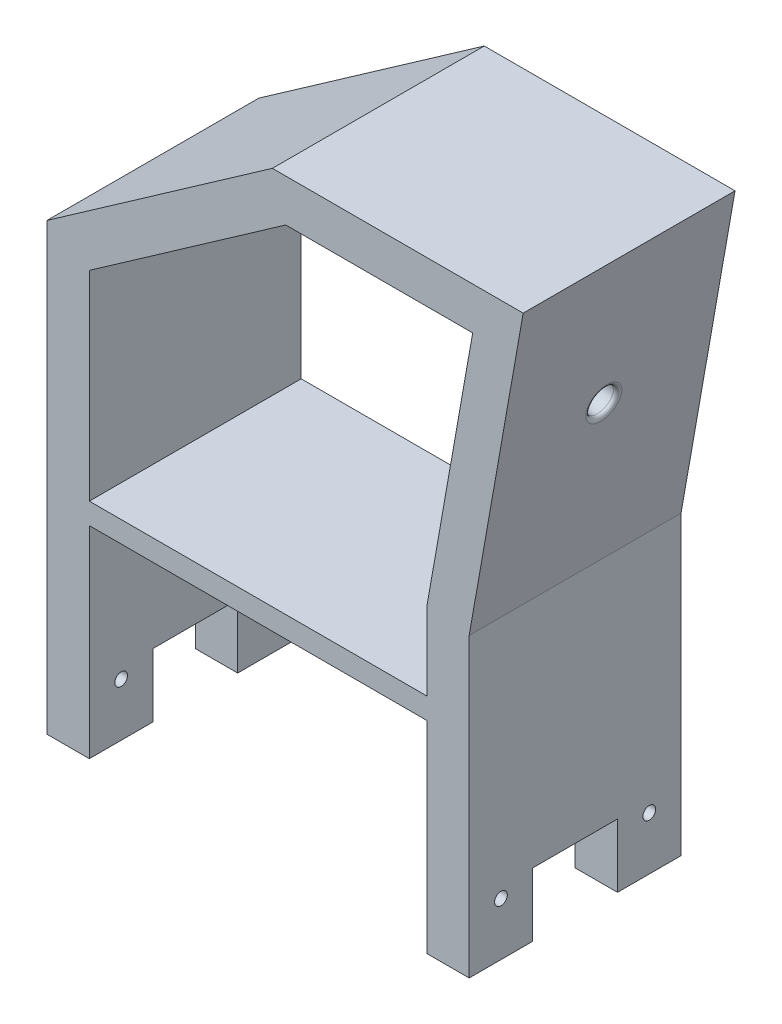
ISO-10303-21;
HEADER;
FILE_DESCRIPTION(('STEP AP214'),'2;1');
FILE_NAME('part.step','',(''),(''),'','','');
FILE_SCHEMA(('AUTOMOTIVE_DESIGN { 1 0 10303 214 1 1 1 1 }'));
ENDSEC;
DATA;
#1=APPLICATION_CONTEXT('core data for automotive mechanical design processes');
#2=APPLICATION_PROTOCOL_DEFINITION('international standard','automotive_design',2000,#1);
#3=PRODUCT_CONTEXT('',#1,'mechanical');
#4=PRODUCT('Part','Part','',(#3));
#5=PRODUCT_RELATED_PRODUCT_CATEGORY('part','',(#4));
#6=PRODUCT_DEFINITION_FORMATION('','',#4);
#7=PRODUCT_DEFINITION_CONTEXT('part definition',#1,'design');
#8=PRODUCT_DEFINITION('design','',#6,#7);
#9=PRODUCT_DEFINITION_SHAPE('','',#8);
#10=(LENGTH_UNIT() NAMED_UNIT(*) SI_UNIT(.MILLI.,.METRE.));
#11=(NAMED_UNIT(*) PLANE_ANGLE_UNIT() SI_UNIT($,.RADIAN.));
#12=(NAMED_UNIT(*) SI_UNIT($,.STERADIAN.) SOLID_ANGLE_UNIT());
#13=UNCERTAINTY_MEASURE_WITH_UNIT(LENGTH_MEASURE(1.E-05),#10,'distance_accuracy_value','');
#14=(GEOMETRIC_REPRESENTATION_CONTEXT(3) GLOBAL_UNCERTAINTY_ASSIGNED_CONTEXT((#13)) GLOBAL_UNIT_ASSIGNED_CONTEXT((#10,
#11,#12)) REPRESENTATION_CONTEXT('',''));
#15=CARTESIAN_POINT('',(0.,0.,0.));
#16=DIRECTION('',(0.,0.,1.));
#17=DIRECTION('',(1.,0.,0.));
#18=AXIS2_PLACEMENT_3D('',#15,#16,#17);
#19=CARTESIAN_POINT('',(71.8800104345077,105.,35.));
#20=DIRECTION('',(0.,-1.,0.));
#21=DIRECTION('',(1.,0.,0.));
#22=AXIS2_PLACEMENT_3D('',#19,#20,#21);
#23=PLANE('',#22);
#24=DIRECTION('',(0.,0.,-1.));
#25=VECTOR('',#24,1.);
#26=CARTESIAN_POINT('',(-30.5064857593433,105.,50.));
#27=LINE('',#26,#25);
#28=CARTESIAN_POINT('',(-30.5064857593433,105.,50.));
#29=VERTEX_POINT('',#28);
#30=CARTESIAN_POINT('',(-30.5064857593433,105.,35.));
#31=VERTEX_POINT('',#30);
#32=EDGE_CURVE('E370',#29,#31,#27,.T.);
#33=ORIENTED_EDGE('',*,*,#32,.F.);
#34=DIRECTION('',(1.,0.,0.));
#35=VECTOR('',#34,1.);
#36=CARTESIAN_POINT('',(0.,105.,50.));
#37=LINE('',#36,#35);
#38=CARTESIAN_POINT('',(-40.5064857593433,105.,50.));
#39=VERTEX_POINT('',#38);
#40=EDGE_CURVE('E369',#39,#29,#37,.T.);
#41=ORIENTED_EDGE('',*,*,#40,.F.);
#42=DIRECTION('',(0.,0.,-1.));
#43=VECTOR('',#42,1.);
#44=CARTESIAN_POINT('',(-40.5064857593433,105.,50.));
#45=LINE('',#44,#43);
#46=CARTESIAN_POINT('',(-40.5064857593433,105.,35.));
#47=VERTEX_POINT('',#46);
#48=EDGE_CURVE('E240',#39,#47,#45,.T.);
#49=ORIENTED_EDGE('',*,*,#48,.T.);
#50=DIRECTION('',(-1.,0.,0.));
#51=VECTOR('',#50,1.);
#52=CARTESIAN_POINT('',(71.8800104345077,105.,35.));
#53=LINE('',#52,#51);
#54=EDGE_CURVE('E11',#31,#47,#53,.T.);
#55=ORIENTED_EDGE('',*,*,#54,.F.);
#56=EDGE_LOOP('',(#33,#41,#49,#55));
#57=FACE_BOUND('',#56,.T.);
#58=ADVANCED_FACE('F43',(#57),#23,.T.);
#59=CARTESIAN_POINT('',(71.8800104345077,120.,35.));
#60=DIRECTION('',(0.,0.,-1.));
#61=DIRECTION('',(-1.,0.,0.));
#62=AXIS2_PLACEMENT_3D('',#59,#60,#61);
#63=PLANE('',#62);
#64=DIRECTION('',(0.,1.,0.));
#65=VECTOR('',#64,1.);
#66=CARTESIAN_POINT('',(-30.5064857593433,204.794329494483,35.));
#67=LINE('',#66,#65);
#68=CARTESIAN_POINT('',(-30.5064857593433,120.,35.));
#69=VERTEX_POINT('',#68);
#70=EDGE_CURVE('E374',#31,#69,#67,.T.);
#71=ORIENTED_EDGE('',*,*,#70,.F.);
#72=ORIENTED_EDGE('',*,*,#54,.T.);
#73=DIRECTION('',(0.,1.,0.));
#74=VECTOR('',#73,1.);
#75=CARTESIAN_POINT('',(-40.5064857593433,210.,35.));
#76=LINE('',#75,#74);
#77=CARTESIAN_POINT('',(-40.5064857593433,120.,35.));
#78=VERTEX_POINT('',#77);
#79=EDGE_CURVE('E245',#47,#78,#76,.T.);
#80=ORIENTED_EDGE('',*,*,#79,.T.);
#81=DIRECTION('',(-1.,0.,0.));
#82=VECTOR('',#81,1.);
#83=CARTESIAN_POINT('',(71.8800104345077,120.,35.));
#84=LINE('',#83,#82);
#85=EDGE_CURVE('E353',#69,#78,#84,.T.);
#86=ORIENTED_EDGE('',*,*,#85,.F.);
#87=EDGE_LOOP('',(#71,#72,#80,#86));
#88=FACE_BOUND('',#87,.T.);
#89=ADVANCED_FACE('F424',(#88),#63,.T.);
#90=CARTESIAN_POINT('',(71.8800104345077,120.,15.));
#91=DIRECTION('',(0.,-1.,0.));
#92=DIRECTION('',(1.,0.,0.));
#93=AXIS2_PLACEMENT_3D('',#90,#91,#92);
#94=PLANE('',#93);
#95=DIRECTION('',(0.,0.,-1.));
#96=VECTOR('',#95,1.);
#97=CARTESIAN_POINT('',(-30.5064857593433,120.,50.));
#98=LINE('',#97,#96);
#99=CARTESIAN_POINT('',(-30.5064857593433,120.,15.));
#100=VERTEX_POINT('',#99);
#101=EDGE_CURVE('E378',#69,#100,#98,.T.);
#102=ORIENTED_EDGE('',*,*,#101,.F.);
#103=ORIENTED_EDGE('',*,*,#85,.T.);
#104=DIRECTION('',(0.,0.,-1.));
#105=VECTOR('',#104,1.);
#106=CARTESIAN_POINT('',(-40.5064857593433,120.,50.));
#107=LINE('',#106,#105);
#108=CARTESIAN_POINT('',(-40.5064857593433,120.,15.));
#109=VERTEX_POINT('',#108);
#110=EDGE_CURVE('E415',#78,#109,#107,.T.);
#111=ORIENTED_EDGE('',*,*,#110,.T.);
#112=DIRECTION('',(-1.,0.,0.));
#113=VECTOR('',#112,1.);
#114=CARTESIAN_POINT('',(71.8800104345077,120.,15.));
#115=LINE('',#114,#113);
#116=EDGE_CURVE('E357',#100,#109,#115,.T.);
#117=ORIENTED_EDGE('',*,*,#116,.F.);
#118=EDGE_LOOP('',(#102,#103,#111,#117));
#119=FACE_BOUND('',#118,.T.);
#120=ADVANCED_FACE('F431',(#119),#94,.T.);
#121=CARTESIAN_POINT('',(71.8800104345077,105.,15.));
#122=DIRECTION('',(0.,0.,1.));
#123=DIRECTION('',(1.,0.,0.));
#124=AXIS2_PLACEMENT_3D('',#121,#122,#123);
#125=PLANE('',#124);
#126=DIRECTION('',(0.,-1.,0.));
#127=VECTOR('',#126,1.);
#128=CARTESIAN_POINT('',(-30.5064857593433,204.794329494483,15.));
#129=LINE('',#128,#127);
#130=CARTESIAN_POINT('',(-30.5064857593433,105.,15.));
#131=VERTEX_POINT('',#130);
#132=EDGE_CURVE('E382',#100,#131,#129,.T.);
#133=ORIENTED_EDGE('',*,*,#132,.F.);
#134=ORIENTED_EDGE('',*,*,#116,.T.);
#135=DIRECTION('',(0.,-1.,0.));
#136=VECTOR('',#135,1.);
#137=CARTESIAN_POINT('',(-40.5064857593433,210.,15.));
#138=LINE('',#137,#136);
#139=CARTESIAN_POINT('',(-40.5064857593433,105.,15.));
#140=VERTEX_POINT('',#139);
#141=EDGE_CURVE('E411',#109,#140,#138,.T.);
#142=ORIENTED_EDGE('',*,*,#141,.T.);
#143=DIRECTION('',(-1.,0.,0.));
#144=VECTOR('',#143,1.);
#145=CARTESIAN_POINT('',(71.8800104345077,105.,15.));
#146=LINE('',#145,#144);
#147=EDGE_CURVE('E361',#131,#140,#146,.T.);
#148=ORIENTED_EDGE('',*,*,#147,.F.);
#149=EDGE_LOOP('',(#133,#134,#142,#148));
#150=FACE_BOUND('',#149,.T.);
#151=ADVANCED_FACE('F437',(#150),#125,.T.);
#152=CARTESIAN_POINT('',(71.8800104345077,105.,0.));
#153=DIRECTION('',(0.,-1.,0.));
#154=DIRECTION('',(1.,0.,0.));
#155=AXIS2_PLACEMENT_3D('',#152,#153,#154);
#156=PLANE('',#155);
#157=DIRECTION('',(0.,0.,-1.));
#158=VECTOR('',#157,1.);
#159=CARTESIAN_POINT('',(-30.5064857593433,105.,50.));
#160=LINE('',#159,#158);
#161=CARTESIAN_POINT('',(-30.5064857593433,105.,0.));
#162=VERTEX_POINT('',#161);
#163=EDGE_CURVE('E386',#131,#162,#160,.T.);
#164=ORIENTED_EDGE('',*,*,#163,.F.);
#165=ORIENTED_EDGE('',*,*,#147,.T.);
#166=DIRECTION('',(0.,0.,-1.));
#167=VECTOR('',#166,1.);
#168=CARTESIAN_POINT('',(-40.5064857593433,105.,50.));
#169=LINE('',#168,#167);
#170=CARTESIAN_POINT('',(-40.5064857593433,105.,0.));
#171=VERTEX_POINT('',#170);
#172=EDGE_CURVE('E232',#140,#171,#169,.T.);
#173=ORIENTED_EDGE('',*,*,#172,.T.);
#174=DIRECTION('',(1.,0.,0.));
#175=VECTOR('',#174,1.);
#176=CARTESIAN_POINT('',(0.,105.,0.));
#177=LINE('',#176,#175);
#178=EDGE_CURVE('E231',#171,#162,#177,.T.);
#179=ORIENTED_EDGE('',*,*,#178,.T.);
#180=EDGE_LOOP('',(#164,#165,#173,#179));
#181=FACE_BOUND('',#180,.T.);
#182=ADVANCED_FACE('F439',(#181),#156,.T.);
#183=DIRECTION('',(0.,0.,1.));
#184=VECTOR('',#183,1.);
#185=CARTESIAN_POINT('',(49.130974017595,105.,50.));
#186=LINE('',#185,#184);
#187=CARTESIAN_POINT('',(49.130974017595,105.,35.));
#188=VERTEX_POINT('',#187);
#189=CARTESIAN_POINT('',(49.130974017595,105.,50.));
#190=VERTEX_POINT('',#189);
#191=EDGE_CURVE('E390',#188,#190,#186,.T.);
#192=ORIENTED_EDGE('',*,*,#191,.F.);
#193=CARTESIAN_POINT('',(59.130974017595,105.,35.));
#194=VERTEX_POINT('',#193);
#195=EDGE_CURVE('E53',#194,#188,#53,.T.);
#196=ORIENTED_EDGE('',*,*,#195,.F.);
#197=DIRECTION('',(0.,0.,1.));
#198=VECTOR('',#197,1.);
#199=CARTESIAN_POINT('',(59.130974017595,105.,50.));
#200=LINE('',#199,#198);
#201=CARTESIAN_POINT('',(59.130974017595,105.,50.));
#202=VERTEX_POINT('',#201);
#203=EDGE_CURVE('E258',#194,#202,#200,.T.);
#204=ORIENTED_EDGE('',*,*,#203,.T.);
#205=EDGE_CURVE('E364',#190,#202,#37,.T.);
#206=ORIENTED_EDGE('',*,*,#205,.F.);
#207=EDGE_LOOP('',(#192,#196,#204,#206));
#208=FACE_BOUND('',#207,.T.);
#209=ADVANCED_FACE('F455',(#208),#23,.T.);
#210=DIRECTION('',(0.,-1.,0.));
#211=VECTOR('',#210,1.);
#212=CARTESIAN_POINT('',(49.130974017595,10.,35.));
#213=LINE('',#212,#211);
#214=CARTESIAN_POINT('',(49.130974017595,120.,35.));
#215=VERTEX_POINT('',#214);
#216=EDGE_CURVE('E394',#215,#188,#213,.T.);
#217=ORIENTED_EDGE('',*,*,#216,.F.);
#218=CARTESIAN_POINT('',(59.130974017595,120.,35.));
#219=VERTEX_POINT('',#218);
#220=EDGE_CURVE('E356',#219,#215,#84,.T.);
#221=ORIENTED_EDGE('',*,*,#220,.F.);
#222=DIRECTION('',(0.,-1.,0.));
#223=VECTOR('',#222,1.);
#224=CARTESIAN_POINT('',(59.130974017595,0.,35.));
#225=LINE('',#224,#223);
#226=EDGE_CURVE('E254',#219,#194,#225,.T.);
#227=ORIENTED_EDGE('',*,*,#226,.T.);
#228=ORIENTED_EDGE('',*,*,#195,.T.);
#229=EDGE_LOOP('',(#217,#221,#227,#228));
#230=FACE_BOUND('',#229,.T.);
#231=ADVANCED_FACE('F459',(#230),#63,.T.);
#232=DIRECTION('',(0.,0.,1.));
#233=VECTOR('',#232,1.);
#234=CARTESIAN_POINT('',(49.130974017595,120.,50.));
#235=LINE('',#234,#233);
#236=CARTESIAN_POINT('',(49.130974017595,120.,15.));
#237=VERTEX_POINT('',#236);
#238=EDGE_CURVE('E398',#237,#215,#235,.T.);
#239=ORIENTED_EDGE('',*,*,#238,.F.);
#240=CARTESIAN_POINT('',(59.130974017595,120.,15.));
#241=VERTEX_POINT('',#240);
#242=EDGE_CURVE('E360',#241,#237,#115,.T.);
#243=ORIENTED_EDGE('',*,*,#242,.F.);
#244=DIRECTION('',(0.,0.,1.));
#245=VECTOR('',#244,1.);
#246=CARTESIAN_POINT('',(59.130974017595,120.,50.));
#247=LINE('',#246,#245);
#248=EDGE_CURVE('E247',#241,#219,#247,.T.);
#249=ORIENTED_EDGE('',*,*,#248,.T.);
#250=ORIENTED_EDGE('',*,*,#220,.T.);
#251=EDGE_LOOP('',(#239,#243,#249,#250));
#252=FACE_BOUND('',#251,.T.);
#253=ADVANCED_FACE('F725',(#252),#94,.T.);
#254=DIRECTION('',(0.,1.,0.));
#255=VECTOR('',#254,1.);
#256=CARTESIAN_POINT('',(49.130974017595,10.,15.));
#257=LINE('',#256,#255);
#258=CARTESIAN_POINT('',(49.130974017595,105.,15.));
#259=VERTEX_POINT('',#258);
#260=EDGE_CURVE('E402',#259,#237,#257,.T.);
#261=ORIENTED_EDGE('',*,*,#260,.F.);
#262=CARTESIAN_POINT('',(59.130974017595,105.,15.));
#263=VERTEX_POINT('',#262);
#264=EDGE_CURVE('E351',#263,#259,#146,.T.);
#265=ORIENTED_EDGE('',*,*,#264,.F.);
#266=DIRECTION('',(0.,1.,0.));
#267=VECTOR('',#266,1.);
#268=CARTESIAN_POINT('',(59.130974017595,0.,15.));
#269=LINE('',#268,#267);
#270=EDGE_CURVE('E238',#263,#241,#269,.T.);
#271=ORIENTED_EDGE('',*,*,#270,.T.);
#272=ORIENTED_EDGE('',*,*,#242,.T.);
#273=EDGE_LOOP('',(#261,#265,#271,#272));
#274=FACE_BOUND('',#273,.T.);
#275=ADVANCED_FACE('F552',(#274),#125,.T.);
#276=DIRECTION('',(0.,0.,1.));
#277=VECTOR('',#276,1.);
#278=CARTESIAN_POINT('',(49.130974017595,105.,50.));
#279=LINE('',#278,#277);
#280=CARTESIAN_POINT('',(49.130974017595,105.,0.));
#281=VERTEX_POINT('',#280);
#282=EDGE_CURVE('E229',#281,#259,#279,.T.);
#283=ORIENTED_EDGE('',*,*,#282,.F.);
#284=CARTESIAN_POINT('',(59.130974017595,105.,0.));
#285=VERTEX_POINT('',#284);
#286=EDGE_CURVE('E212',#281,#285,#177,.T.);
#287=ORIENTED_EDGE('',*,*,#286,.T.);
#288=DIRECTION('',(0.,0.,1.));
#289=VECTOR('',#288,1.);
#290=CARTESIAN_POINT('',(59.130974017595,105.,50.));
#291=LINE('',#290,#289);
#292=EDGE_CURVE('E227',#285,#263,#291,.T.);
#293=ORIENTED_EDGE('',*,*,#292,.T.);
#294=ORIENTED_EDGE('',*,*,#264,.T.);
#295=EDGE_LOOP('',(#283,#287,#293,#294));
#296=FACE_BOUND('',#295,.T.);
#297=ADVANCED_FACE('F226',(#296),#156,.T.);
#298=CARTESIAN_POINT('',(49.130974017595,10.,50.));
#299=DIRECTION('',(-1.,0.,0.));
#300=DIRECTION('',(0.,0.,1.));
#301=AXIS2_PLACEMENT_3D('',#298,#299,#300);
#302=PLANE('',#301);
#303=CARTESIAN_POINT('',(49.130974017595,117.5,7.5));
#304=DIRECTION('',(-1.,0.,0.));
#305=DIRECTION('',(0.,0.,1.));
#306=AXIS2_PLACEMENT_3D('',#303,#304,#305);
#307=CIRCLE('',#306,1.5);
#308=CARTESIAN_POINT('',(49.130974017595,117.5,9.));
#309=VERTEX_POINT('',#308);
#310=EDGE_CURVE('E262',#309,#309,#307,.T.);
#311=ORIENTED_EDGE('',*,*,#310,.F.);
#312=EDGE_LOOP('',(#311));
#313=FACE_BOUND('',#312,.T.);
#314=CARTESIAN_POINT('',(49.130974017595,117.5,42.5));
#315=DIRECTION('',(-1.,0.,0.));
#316=DIRECTION('',(0.,0.,1.));
#317=AXIS2_PLACEMENT_3D('',#314,#315,#316);
#318=CIRCLE('',#317,1.5);
#319=CARTESIAN_POINT('',(49.130974017595,117.5,44.));
#320=VERTEX_POINT('',#319);
#321=EDGE_CURVE('E910',#320,#320,#318,.T.);
#322=ORIENTED_EDGE('',*,*,#321,.F.);
#323=EDGE_LOOP('',(#322));
#324=FACE_BOUND('',#323,.T.);
#325=DIRECTION('',(0.,1.,0.));
#326=VECTOR('',#325,1.);
#327=CARTESIAN_POINT('',(49.130974017595,10.,0.));
#328=LINE('',#327,#326);
#329=CARTESIAN_POINT('',(49.130974017595,152.635730725864,0.));
#330=VERTEX_POINT('',#329);
#331=EDGE_CURVE('E47',#281,#330,#328,.T.);
#332=ORIENTED_EDGE('',*,*,#331,.F.);
#333=ORIENTED_EDGE('',*,*,#282,.T.);
#334=ORIENTED_EDGE('',*,*,#260,.T.);
#335=ORIENTED_EDGE('',*,*,#238,.T.);
#336=ORIENTED_EDGE('',*,*,#216,.T.);
#337=ORIENTED_EDGE('',*,*,#191,.T.);
#338=DIRECTION('',(0.,1.,0.));
#339=VECTOR('',#338,1.);
#340=CARTESIAN_POINT('',(49.130974017595,10.,50.));
#341=LINE('',#340,#339);
#342=CARTESIAN_POINT('',(49.130974017595,152.635730725864,50.));
#343=VERTEX_POINT('',#342);
#344=EDGE_CURVE('E278',#190,#343,#341,.T.);
#345=ORIENTED_EDGE('',*,*,#344,.T.);
#346=DIRECTION('',(0.,0.,1.));
#347=VECTOR('',#346,1.);
#348=CARTESIAN_POINT('',(49.1309740175949,152.635730725864,0.));
#349=LINE('',#348,#347);
#350=EDGE_CURVE('E325',#330,#343,#349,.T.);
#351=ORIENTED_EDGE('',*,*,#350,.F.);
#352=EDGE_LOOP('',(#332,#333,#334,#335,#336,#337,#345,#351));
#353=FACE_BOUND('',#352,.T.);
#354=ADVANCED_FACE('F449',(#313,#324,#353),#302,.T.);
#355=CARTESIAN_POINT('',(-30.5064857593433,204.794329494483,50.));
#356=DIRECTION('',(1.,0.,0.));
#357=DIRECTION('',(0.,0.,-1.));
#358=AXIS2_PLACEMENT_3D('',#355,#356,#357);
#359=PLANE('',#358);
#360=CARTESIAN_POINT('',(-30.5064857593433,117.5,7.5));
#361=DIRECTION('',(1.,0.,0.));
#362=DIRECTION('',(0.,0.,-1.));
#363=AXIS2_PLACEMENT_3D('',#360,#361,#362);
#364=CIRCLE('',#363,1.5);
#365=CARTESIAN_POINT('',(-30.5064857593433,117.5,6.));
#366=VERTEX_POINT('',#365);
#367=EDGE_CURVE('E887',#366,#366,#364,.T.);
#368=ORIENTED_EDGE('',*,*,#367,.F.);
#369=EDGE_LOOP('',(#368));
#370=FACE_BOUND('',#369,.T.);
#371=CARTESIAN_POINT('',(-30.5064857593433,117.5,42.5));
#372=DIRECTION('',(1.,0.,0.));
#373=DIRECTION('',(0.,0.,-1.));
#374=AXIS2_PLACEMENT_3D('',#371,#372,#373);
#375=CIRCLE('',#374,1.5);
#376=CARTESIAN_POINT('',(-30.5064857593433,117.5,41.));
#377=VERTEX_POINT('',#376);
#378=EDGE_CURVE('E898',#377,#377,#375,.T.);
#379=ORIENTED_EDGE('',*,*,#378,.F.);
#380=EDGE_LOOP('',(#379));
#381=FACE_BOUND('',#380,.T.);
#382=ORIENTED_EDGE('',*,*,#132,.T.);
#383=ORIENTED_EDGE('',*,*,#163,.T.);
#384=DIRECTION('',(0.,-1.,0.));
#385=VECTOR('',#384,1.);
#386=CARTESIAN_POINT('',(-30.5064857593433,204.794329494483,0.));
#387=LINE('',#386,#385);
#388=CARTESIAN_POINT('',(-30.5064857593433,152.635730725864,0.));
#389=VERTEX_POINT('',#388);
#390=EDGE_CURVE('E284',#389,#162,#387,.T.);
#391=ORIENTED_EDGE('',*,*,#390,.F.);
#392=DIRECTION('',(0.,0.,1.));
#393=VECTOR('',#392,1.);
#394=CARTESIAN_POINT('',(-30.5064857593433,152.635730725864,0.));
#395=LINE('',#394,#393);
#396=CARTESIAN_POINT('',(-30.5064857593433,152.635730725864,50.));
#397=VERTEX_POINT('',#396);
#398=EDGE_CURVE('E321',#389,#397,#395,.T.);
#399=ORIENTED_EDGE('',*,*,#398,.T.);
#400=DIRECTION('',(0.,-1.,0.));
#401=VECTOR('',#400,1.);
#402=CARTESIAN_POINT('',(-30.5064857593433,204.794329494483,50.));
#403=LINE('',#402,#401);
#404=EDGE_CURVE('E61',#397,#29,#403,.T.);
#405=ORIENTED_EDGE('',*,*,#404,.T.);
#406=ORIENTED_EDGE('',*,*,#32,.T.);
#407=ORIENTED_EDGE('',*,*,#70,.T.);
#408=ORIENTED_EDGE('',*,*,#101,.T.);
#409=EDGE_LOOP('',(#382,#383,#391,#399,#405,#406,#407,#408));
#410=FACE_BOUND('',#409,.T.);
#411=ADVANCED_FACE('F434',(#370,#381,#410),#359,.T.);
#412=CARTESIAN_POINT('',(0.,0.,50.));
#413=DIRECTION('',(0.,0.,1.));
#414=DIRECTION('',(1.,0.,0.));
#415=AXIS2_PLACEMENT_3D('',#412,#413,#414);
#416=PLANE('',#415);
#417=CARTESIAN_POINT('',(49.130974017595,157.635730725864,50.));
#418=VERTEX_POINT('',#417);
#419=CARTESIAN_POINT('',(49.130974017595,175.874886635259,50.));
#420=VERTEX_POINT('',#419);
#421=EDGE_CURVE('E69',#418,#420,#341,.T.);
#422=ORIENTED_EDGE('',*,*,#421,.F.);
#423=DIRECTION('',(-1.,0.,0.));
#424=VECTOR('',#423,1.);
#425=CARTESIAN_POINT('',(-30.5064857593433,157.635730725864,50.));
#426=LINE('',#425,#424);
#427=CARTESIAN_POINT('',(-30.5064857593433,157.635730725864,50.));
#428=VERTEX_POINT('',#427);
#429=EDGE_CURVE('E336',#418,#428,#426,.T.);
#430=ORIENTED_EDGE('',*,*,#429,.T.);
#431=CARTESIAN_POINT('',(-30.5064857593433,204.794329494483,50.));
#432=VERTEX_POINT('',#431);
#433=EDGE_CURVE('E274',#432,#428,#403,.T.);
#434=ORIENTED_EDGE('',*,*,#433,.F.);
#435=DIRECTION('',(-0.819152044288993,-0.573576436351044,0.));
#436=VECTOR('',#435,1.);
#437=CARTESIAN_POINT('',(15.8402534076994,237.246665630685,50.));
#438=LINE('',#437,#436);
#439=CARTESIAN_POINT('',(15.8402534076994,237.246665630685,50.));
#440=VERTEX_POINT('',#439);
#441=EDGE_CURVE('E317',#440,#432,#438,.T.);
#442=ORIENTED_EDGE('',*,*,#441,.F.);
#443=DIRECTION('',(-1.,0.,0.));
#444=VECTOR('',#443,1.);
#445=CARTESIAN_POINT('',(59.9524745085656,237.246665630685,50.));
#446=LINE('',#445,#444);
#447=CARTESIAN_POINT('',(59.9524745085656,237.246665630685,50.));
#448=VERTEX_POINT('',#447);
#449=EDGE_CURVE('E313',#448,#440,#446,.T.);
#450=ORIENTED_EDGE('',*,*,#449,.F.);
#451=DIRECTION('',(0.17364817766693,0.984807753012208,0.));
#452=VECTOR('',#451,1.);
#453=CARTESIAN_POINT('',(49.130974017595,175.874886635259,50.));
#454=LINE('',#453,#452);
#455=EDGE_CURVE('E280',#420,#448,#454,.T.);
#456=ORIENTED_EDGE('',*,*,#455,.F.);
#457=EDGE_LOOP('',(#422,#430,#434,#442,#450,#456));
#458=FACE_BOUND('',#457,.T.);
#459=DIRECTION('',(0.,-1.,0.));
#460=VECTOR('',#459,1.);
#461=CARTESIAN_POINT('',(-40.5064857593433,210.,50.));
#462=LINE('',#461,#460);
#463=CARTESIAN_POINT('',(-40.5064857593433,210.,50.));
#464=VERTEX_POINT('',#463);
#465=EDGE_CURVE('E266',#464,#39,#462,.T.);
#466=ORIENTED_EDGE('',*,*,#465,.T.);
#467=ORIENTED_EDGE('',*,*,#40,.T.);
#468=ORIENTED_EDGE('',*,*,#404,.F.);
#469=DIRECTION('',(1.,0.,0.));
#470=VECTOR('',#469,1.);
#471=CARTESIAN_POINT('',(49.1309740175949,152.635730725864,50.));
#472=LINE('',#471,#470);
#473=EDGE_CURVE('E339',#397,#343,#472,.T.);
#474=ORIENTED_EDGE('',*,*,#473,.T.);
#475=ORIENTED_EDGE('',*,*,#344,.F.);
#476=ORIENTED_EDGE('',*,*,#205,.T.);
#477=DIRECTION('',(0.,1.,0.));
#478=VECTOR('',#477,1.);
#479=CARTESIAN_POINT('',(59.130974017595,0.,50.));
#480=LINE('',#479,#478);
#481=CARTESIAN_POINT('',(59.130974017595,175.,50.));
#482=VERTEX_POINT('',#481);
#483=EDGE_CURVE('E263',#202,#482,#480,.T.);
#484=ORIENTED_EDGE('',*,*,#483,.T.);
#485=DIRECTION('',(0.17364817766693,0.984807753012208,0.));
#486=VECTOR('',#485,1.);
#487=CARTESIAN_POINT('',(59.130974017595,175.,50.));
#488=LINE('',#487,#486);
#489=CARTESIAN_POINT('',(71.8700104345077,247.246665630685,50.));
#490=VERTEX_POINT('',#489);
#491=EDGE_CURVE('E221',#482,#490,#488,.T.);
#492=ORIENTED_EDGE('',*,*,#491,.T.);
#493=DIRECTION('',(-1.,0.,0.));
#494=VECTOR('',#493,1.);
#495=CARTESIAN_POINT('',(71.8700104345077,247.246665630685,50.));
#496=LINE('',#495,#494);
#497=CARTESIAN_POINT('',(12.6872655189098,247.246665630685,50.));
#498=VERTEX_POINT('',#497);
#499=EDGE_CURVE('E492',#490,#498,#496,.T.);
#500=ORIENTED_EDGE('',*,*,#499,.T.);
#501=DIRECTION('',(-0.819152044288993,-0.573576436351044,0.));
#502=VECTOR('',#501,1.);
#503=CARTESIAN_POINT('',(12.6872655189098,247.246665630685,50.));
#504=LINE('',#503,#502);
#505=EDGE_CURVE('E269',#498,#464,#504,.T.);
#506=ORIENTED_EDGE('',*,*,#505,.T.);
#507=EDGE_LOOP('',(#466,#467,#468,#474,#475,#476,#484,#492,#500,#506));
#508=FACE_BOUND('',#507,.T.);
#509=ADVANCED_FACE('F311',(#458,#508),#416,.T.);
#510=CARTESIAN_POINT('',(0.,0.,0.));
#511=DIRECTION('',(0.,0.,1.));
#512=DIRECTION('',(1.,0.,0.));
#513=AXIS2_PLACEMENT_3D('',#510,#511,#512);
#514=PLANE('',#513);
#515=DIRECTION('',(-1.,0.,0.));
#516=VECTOR('',#515,1.);
#517=CARTESIAN_POINT('',(-30.5064857593433,157.635730725864,0.));
#518=LINE('',#517,#516);
#519=CARTESIAN_POINT('',(49.130974017595,157.635730725864,0.));
#520=VERTEX_POINT('',#519);
#521=CARTESIAN_POINT('',(-30.5064857593433,157.635730725864,0.));
#522=VERTEX_POINT('',#521);
#523=EDGE_CURVE('E324',#520,#522,#518,.T.);
#524=ORIENTED_EDGE('',*,*,#523,.F.);
#525=CARTESIAN_POINT('',(49.130974017595,175.874886635259,0.));
#526=VERTEX_POINT('',#525);
#527=EDGE_CURVE('E335',#520,#526,#328,.T.);
#528=ORIENTED_EDGE('',*,*,#527,.T.);
#529=DIRECTION('',(0.17364817766693,0.984807753012208,0.));
#530=VECTOR('',#529,1.);
#531=CARTESIAN_POINT('',(49.130974017595,175.874886635259,0.));
#532=LINE('',#531,#530);
#533=CARTESIAN_POINT('',(59.9524745085656,237.246665630685,0.));
#534=VERTEX_POINT('',#533);
#535=EDGE_CURVE('E306',#526,#534,#532,.T.);
#536=ORIENTED_EDGE('',*,*,#535,.T.);
#537=DIRECTION('',(-1.,0.,0.));
#538=VECTOR('',#537,1.);
#539=CARTESIAN_POINT('',(59.9524745085656,237.246665630685,0.));
#540=LINE('',#539,#538);
#541=CARTESIAN_POINT('',(15.8402534076994,237.246665630685,0.));
#542=VERTEX_POINT('',#541);
#543=EDGE_CURVE('E469',#534,#542,#540,.T.);
#544=ORIENTED_EDGE('',*,*,#543,.T.);
#545=DIRECTION('',(-0.819152044288993,-0.573576436351044,0.));
#546=VECTOR('',#545,1.);
#547=CARTESIAN_POINT('',(15.8402534076994,237.246665630685,0.));
#548=LINE('',#547,#546);
#549=CARTESIAN_POINT('',(-30.5064857593433,204.794329494483,0.));
#550=VERTEX_POINT('',#549);
#551=EDGE_CURVE('E292',#542,#550,#548,.T.);
#552=ORIENTED_EDGE('',*,*,#551,.T.);
#553=EDGE_CURVE('E281',#550,#522,#387,.T.);
#554=ORIENTED_EDGE('',*,*,#553,.T.);
#555=EDGE_LOOP('',(#524,#528,#536,#544,#552,#554));
#556=FACE_BOUND('',#555,.T.);
#557=ORIENTED_EDGE('',*,*,#178,.F.);
#558=DIRECTION('',(0.,-1.,0.));
#559=VECTOR('',#558,1.);
#560=CARTESIAN_POINT('',(-40.5064857593433,210.,0.));
#561=LINE('',#560,#559);
#562=CARTESIAN_POINT('',(-40.5064857593433,210.,0.));
#563=VERTEX_POINT('',#562);
#564=EDGE_CURVE('E220',#563,#171,#561,.T.);
#565=ORIENTED_EDGE('',*,*,#564,.F.);
#566=DIRECTION('',(-0.819152044288993,-0.573576436351044,0.));
#567=VECTOR('',#566,1.);
#568=CARTESIAN_POINT('',(12.6872655189098,247.246665630685,0.));
#569=LINE('',#568,#567);
#570=CARTESIAN_POINT('',(12.6872655189098,247.246665630685,0.));
#571=VERTEX_POINT('',#570);
#572=EDGE_CURVE('E273',#571,#563,#569,.T.);
#573=ORIENTED_EDGE('',*,*,#572,.F.);
#574=DIRECTION('',(-1.,0.,0.));
#575=VECTOR('',#574,1.);
#576=CARTESIAN_POINT('',(71.8700104345077,247.246665630685,0.));
#577=LINE('',#576,#575);
#578=CARTESIAN_POINT('',(71.8700104345077,247.246665630685,0.));
#579=VERTEX_POINT('',#578);
#580=EDGE_CURVE('E512',#579,#571,#577,.T.);
#581=ORIENTED_EDGE('',*,*,#580,.F.);
#582=DIRECTION('',(0.17364817766693,0.984807753012208,0.));
#583=VECTOR('',#582,1.);
#584=CARTESIAN_POINT('',(59.130974017595,175.,0.));
#585=LINE('',#584,#583);
#586=CARTESIAN_POINT('',(59.130974017595,175.,0.));
#587=VERTEX_POINT('',#586);
#588=EDGE_CURVE('E214',#587,#579,#585,.T.);
#589=ORIENTED_EDGE('',*,*,#588,.F.);
#590=DIRECTION('',(0.,1.,0.));
#591=VECTOR('',#590,1.);
#592=CARTESIAN_POINT('',(59.130974017595,0.,0.));
#593=LINE('',#592,#591);
#594=EDGE_CURVE('E208',#285,#587,#593,.T.);
#595=ORIENTED_EDGE('',*,*,#594,.F.);
#596=ORIENTED_EDGE('',*,*,#286,.F.);
#597=ORIENTED_EDGE('',*,*,#331,.T.);
#598=DIRECTION('',(1.,0.,0.));
#599=VECTOR('',#598,1.);
#600=CARTESIAN_POINT('',(49.1309740175949,152.635730725864,0.));
#601=LINE('',#600,#599);
#602=EDGE_CURVE('E340',#389,#330,#601,.T.);
#603=ORIENTED_EDGE('',*,*,#602,.F.);
#604=ORIENTED_EDGE('',*,*,#390,.T.);
#605=EDGE_LOOP('',(#557,#565,#573,#581,#589,#595,#596,#597,#603,#604));
#606=FACE_BOUND('',#605,.T.);
#607=ADVANCED_FACE('F211',(#556,#606),#514,.F.);
#608=CARTESIAN_POINT('',(-40.5064857593433,210.,50.));
#609=DIRECTION('',(1.,0.,0.));
#610=DIRECTION('',(0.,1.,0.));
#611=AXIS2_PLACEMENT_3D('',#608,#609,#610);
#612=PLANE('',#611);
#613=CARTESIAN_POINT('',(-40.5064857593433,117.5,7.5));
#614=DIRECTION('',(-1.,0.,0.));
#615=DIRECTION('',(0.,-1.,0.));
#616=AXIS2_PLACEMENT_3D('',#613,#614,#615);
#617=CIRCLE('',#616,1.5);
#618=CARTESIAN_POINT('',(-40.5064857593433,116.,7.5));
#619=VERTEX_POINT('',#618);
#620=EDGE_CURVE('E890',#619,#619,#617,.T.);
#621=ORIENTED_EDGE('',*,*,#620,.F.);
#622=EDGE_LOOP('',(#621));
#623=FACE_BOUND('',#622,.T.);
#624=CARTESIAN_POINT('',(-40.5064857593433,117.5,42.5));
#625=DIRECTION('',(-1.,0.,0.));
#626=DIRECTION('',(0.,1.,0.));
#627=AXIS2_PLACEMENT_3D('',#624,#625,#626);
#628=CIRCLE('',#627,1.5);
#629=CARTESIAN_POINT('',(-40.5064857593433,119.,42.5));
#630=VERTEX_POINT('',#629);
#631=EDGE_CURVE('E893',#630,#630,#628,.T.);
#632=ORIENTED_EDGE('',*,*,#631,.F.);
#633=EDGE_LOOP('',(#632));
#634=FACE_BOUND('',#633,.T.);
#635=ORIENTED_EDGE('',*,*,#172,.F.);
#636=ORIENTED_EDGE('',*,*,#141,.F.);
#637=ORIENTED_EDGE('',*,*,#110,.F.);
#638=ORIENTED_EDGE('',*,*,#79,.F.);
#639=ORIENTED_EDGE('',*,*,#48,.F.);
#640=ORIENTED_EDGE('',*,*,#465,.F.);
#641=DIRECTION('',(0.,0.,-1.));
#642=VECTOR('',#641,1.);
#643=CARTESIAN_POINT('',(-40.5064857593433,210.,50.));
#644=LINE('',#643,#642);
#645=EDGE_CURVE('E489',#464,#563,#644,.T.);
#646=ORIENTED_EDGE('',*,*,#645,.T.);
#647=ORIENTED_EDGE('',*,*,#564,.T.);
#648=EDGE_LOOP('',(#635,#636,#637,#638,#639,#640,#646,#647));
#649=FACE_BOUND('',#648,.T.);
#650=ADVANCED_FACE('F45',(#623,#634,#649),#612,.F.);
#651=CARTESIAN_POINT('',(59.130974017595,0.,50.));
#652=DIRECTION('',(-1.,0.,0.));
#653=DIRECTION('',(0.,-1.,0.));
#654=AXIS2_PLACEMENT_3D('',#651,#652,#653);
#655=PLANE('',#654);
#656=CARTESIAN_POINT('',(59.130974017595,117.5,7.5));
#657=DIRECTION('',(-1.,0.,0.));
#658=DIRECTION('',(0.,-1.,0.));
#659=AXIS2_PLACEMENT_3D('',#656,#657,#658);
#660=CIRCLE('',#659,1.5);
#661=CARTESIAN_POINT('',(59.130974017595,116.,7.5));
#662=VERTEX_POINT('',#661);
#663=EDGE_CURVE('E892',#662,#662,#660,.F.);
#664=ORIENTED_EDGE('',*,*,#663,.F.);
#665=EDGE_LOOP('',(#664));
#666=FACE_BOUND('',#665,.T.);
#667=CARTESIAN_POINT('',(59.130974017595,117.5,42.5));
#668=DIRECTION('',(-1.,0.,0.));
#669=DIRECTION('',(0.,-1.,0.));
#670=AXIS2_PLACEMENT_3D('',#667,#668,#669);
#671=CIRCLE('',#670,1.5);
#672=CARTESIAN_POINT('',(59.130974017595,116.,42.5));
#673=VERTEX_POINT('',#672);
#674=EDGE_CURVE('E901',#673,#673,#671,.F.);
#675=ORIENTED_EDGE('',*,*,#674,.F.);
#676=EDGE_LOOP('',(#675));
#677=FACE_BOUND('',#676,.T.);
#678=ORIENTED_EDGE('',*,*,#292,.F.);
#679=ORIENTED_EDGE('',*,*,#594,.T.);
#680=DIRECTION('',(0.,0.,-1.));
#681=VECTOR('',#680,1.);
#682=CARTESIAN_POINT('',(59.130974017595,175.,50.));
#683=LINE('',#682,#681);
#684=EDGE_CURVE('E267',#482,#587,#683,.T.);
#685=ORIENTED_EDGE('',*,*,#684,.F.);
#686=ORIENTED_EDGE('',*,*,#483,.F.);
#687=ORIENTED_EDGE('',*,*,#203,.F.);
#688=ORIENTED_EDGE('',*,*,#226,.F.);
#689=ORIENTED_EDGE('',*,*,#248,.F.);
#690=ORIENTED_EDGE('',*,*,#270,.F.);
#691=EDGE_LOOP('',(#678,#679,#685,#686,#687,#688,#689,#690));
#692=FACE_BOUND('',#691,.T.);
#693=ADVANCED_FACE('F235',(#666,#677,#692),#655,.F.);
#694=CARTESIAN_POINT('',(64.9184451935931,213.581150545143,25.));
#695=DIRECTION('',(-0.984807753012208,0.17364817766693,0.));
#696=DIRECTION('',(-0.17364817766693,-0.984807753012208,0.));
#697=AXIS2_PLACEMENT_3D('',#694,#695,#696);
#698=TOROIDAL_SURFACE('',#697,4.2,1.);
#699=CARTESIAN_POINT('',(64.9184451935931,213.581150545143,25.));
#700=DIRECTION('',(-0.984807753012208,0.17364817766693,0.));
#701=DIRECTION('',(-0.17364817766693,-0.984807753012208,0.));
#702=AXIS2_PLACEMENT_3D('',#699,#700,#701);
#703=CIRCLE('',#702,3.2);
#704=CARTESIAN_POINT('',(64.3627710250589,210.429765735504,25.));
#705=VERTEX_POINT('',#704);
#706=EDGE_CURVE('E922',#705,#705,#703,.F.);
#707=ORIENTED_EDGE('',*,*,#706,.F.);
#708=EDGE_LOOP('',(#707));
#709=FACE_BOUND('',#708,.T.);
#710=CARTESIAN_POINT('',(65.9032529466053,213.407502367476,25.));
#711=DIRECTION('',(-0.984807753012208,0.17364817766693,0.));
#712=DIRECTION('',(-0.17364817766693,-0.984807753012208,0.));
#713=AXIS2_PLACEMENT_3D('',#710,#711,#712);
#714=CIRCLE('',#713,4.2);
#715=CARTESIAN_POINT('',(65.1739306004042,209.271309804825,25.));
#716=VERTEX_POINT('',#715);
#717=EDGE_CURVE('E368',#716,#716,#714,.T.);
#718=ORIENTED_EDGE('',*,*,#717,.F.);
#719=EDGE_LOOP('',(#718));
#720=FACE_BOUND('',#719,.T.);
#721=ADVANCED_FACE('F559',(#709,#720),#698,.T.);
#722=DIRECTION('',(0.,0.,1.));
#723=VECTOR('',#722,1.);
#724=CARTESIAN_POINT('',(49.130974017595,157.635730725864,0.));
#725=LINE('',#724,#723);
#726=EDGE_CURVE('E299',#520,#418,#725,.T.);
#727=ORIENTED_EDGE('',*,*,#726,.T.);
#728=ORIENTED_EDGE('',*,*,#421,.T.);
#729=DIRECTION('',(0.,0.,-1.));
#730=VECTOR('',#729,1.);
#731=CARTESIAN_POINT('',(49.130974017595,175.874886635259,50.));
#732=LINE('',#731,#730);
#733=EDGE_CURVE('E297',#420,#526,#732,.T.);
#734=ORIENTED_EDGE('',*,*,#733,.T.);
#735=ORIENTED_EDGE('',*,*,#527,.F.);
#736=EDGE_LOOP('',(#727,#728,#734,#735));
#737=FACE_BOUND('',#736,.T.);
#738=ADVANCED_FACE('F296',(#737),#302,.T.);
#739=DIRECTION('',(0.,0.,1.));
#740=VECTOR('',#739,1.);
#741=CARTESIAN_POINT('',(-30.5064857593433,157.635730725864,0.));
#742=LINE('',#741,#740);
#743=EDGE_CURVE('E331',#522,#428,#742,.T.);
#744=ORIENTED_EDGE('',*,*,#743,.F.);
#745=ORIENTED_EDGE('',*,*,#553,.F.);
#746=DIRECTION('',(0.,0.,-1.));
#747=VECTOR('',#746,1.);
#748=CARTESIAN_POINT('',(-30.5064857593433,204.794329494483,50.));
#749=LINE('',#748,#747);
#750=EDGE_CURVE('E277',#432,#550,#749,.T.);
#751=ORIENTED_EDGE('',*,*,#750,.F.);
#752=ORIENTED_EDGE('',*,*,#433,.T.);
#753=EDGE_LOOP('',(#744,#745,#751,#752));
#754=FACE_BOUND('',#753,.T.);
#755=ADVANCED_FACE('F530',(#754),#359,.T.);
#756=CARTESIAN_POINT('',(59.130974017595,175.,50.));
#757=DIRECTION('',(-0.984807753012208,0.17364817766693,0.));
#758=DIRECTION('',(-0.17364817766693,-0.984807753012208,0.));
#759=AXIS2_PLACEMENT_3D('',#756,#757,#758);
#760=PLANE('',#759);
#761=ORIENTED_EDGE('',*,*,#717,.T.);
#762=EDGE_LOOP('',(#761));
#763=FACE_BOUND('',#762,.T.);
#764=ORIENTED_EDGE('',*,*,#588,.T.);
#765=DIRECTION('',(0.,0.,-1.));
#766=VECTOR('',#765,1.);
#767=CARTESIAN_POINT('',(71.8700104345077,247.246665630685,50.));
#768=LINE('',#767,#766);
#769=EDGE_CURVE('E506',#490,#579,#768,.T.);
#770=ORIENTED_EDGE('',*,*,#769,.F.);
#771=ORIENTED_EDGE('',*,*,#491,.F.);
#772=ORIENTED_EDGE('',*,*,#684,.T.);
#773=EDGE_LOOP('',(#764,#770,#771,#772));
#774=FACE_BOUND('',#773,.T.);
#775=ADVANCED_FACE('F564',(#763,#774),#760,.F.);
#776=CARTESIAN_POINT('',(71.8700104345077,247.246665630685,50.));
#777=DIRECTION('',(0.,-1.,0.));
#778=DIRECTION('',(1.,0.,0.));
#779=AXIS2_PLACEMENT_3D('',#776,#777,#778);
#780=PLANE('',#779);
#781=ORIENTED_EDGE('',*,*,#580,.T.);
#782=DIRECTION('',(0.,0.,-1.));
#783=VECTOR('',#782,1.);
#784=CARTESIAN_POINT('',(12.6872655189098,247.246665630685,50.));
#785=LINE('',#784,#783);
#786=EDGE_CURVE('E501',#498,#571,#785,.T.);
#787=ORIENTED_EDGE('',*,*,#786,.F.);
#788=ORIENTED_EDGE('',*,*,#499,.F.);
#789=ORIENTED_EDGE('',*,*,#769,.T.);
#790=EDGE_LOOP('',(#781,#787,#788,#789));
#791=FACE_BOUND('',#790,.T.);
#792=ADVANCED_FACE('F579',(#791),#780,.F.);
#793=CARTESIAN_POINT('',(12.6872655189098,247.246665630685,50.));
#794=DIRECTION('',(0.573576436351044,-0.819152044288993,0.));
#795=DIRECTION('',(0.819152044288993,0.573576436351044,0.));
#796=AXIS2_PLACEMENT_3D('',#793,#794,#795);
#797=PLANE('',#796);
#798=ORIENTED_EDGE('',*,*,#572,.T.);
#799=ORIENTED_EDGE('',*,*,#645,.F.);
#800=ORIENTED_EDGE('',*,*,#505,.F.);
#801=ORIENTED_EDGE('',*,*,#786,.T.);
#802=EDGE_LOOP('',(#798,#799,#800,#801));
#803=FACE_BOUND('',#802,.T.);
#804=ADVANCED_FACE('F498',(#803),#797,.F.);
#805=CARTESIAN_POINT('',(49.130974017595,175.874886635259,50.));
#806=DIRECTION('',(-0.984807753012208,0.17364817766693,0.));
#807=DIRECTION('',(-0.17364817766693,-0.984807753012208,0.));
#808=AXIS2_PLACEMENT_3D('',#805,#806,#807);
#809=PLANE('',#808);
#810=CARTESIAN_POINT('',(56.0551754164832,215.143984144145,25.));
#811=DIRECTION('',(0.984807753012208,-0.17364817766693,0.));
#812=DIRECTION('',(0.17364817766693,0.984807753012208,0.));
#813=AXIS2_PLACEMENT_3D('',#810,#811,#812);
#814=CIRCLE('',#813,3.2);
#815=CARTESIAN_POINT('',(56.6108495850174,218.295368953785,25.));
#816=VERTEX_POINT('',#815);
#817=EDGE_CURVE('E343',#816,#816,#814,.T.);
#818=ORIENTED_EDGE('',*,*,#817,.T.);
#819=EDGE_LOOP('',(#818));
#820=FACE_BOUND('',#819,.T.);
#821=ORIENTED_EDGE('',*,*,#535,.F.);
#822=ORIENTED_EDGE('',*,*,#733,.F.);
#823=ORIENTED_EDGE('',*,*,#455,.T.);
#824=DIRECTION('',(0.,0.,-1.));
#825=VECTOR('',#824,1.);
#826=CARTESIAN_POINT('',(59.9524745085656,237.246665630685,50.));
#827=LINE('',#826,#825);
#828=EDGE_CURVE('E308',#448,#534,#827,.T.);
#829=ORIENTED_EDGE('',*,*,#828,.T.);
#830=EDGE_LOOP('',(#821,#822,#823,#829));
#831=FACE_BOUND('',#830,.T.);
#832=ADVANCED_FACE('F303',(#820,#831),#809,.T.);
#833=CARTESIAN_POINT('',(59.9524745085656,237.246665630685,50.));
#834=DIRECTION('',(0.,-1.,0.));
#835=DIRECTION('',(0.,0.,-1.));
#836=AXIS2_PLACEMENT_3D('',#833,#834,#835);
#837=PLANE('',#836);
#838=ORIENTED_EDGE('',*,*,#543,.F.);
#839=ORIENTED_EDGE('',*,*,#828,.F.);
#840=ORIENTED_EDGE('',*,*,#449,.T.);
#841=DIRECTION('',(0.,0.,-1.));
#842=VECTOR('',#841,1.);
#843=CARTESIAN_POINT('',(15.8402534076994,237.246665630685,50.));
#844=LINE('',#843,#842);
#845=EDGE_CURVE('E522',#440,#542,#844,.T.);
#846=ORIENTED_EDGE('',*,*,#845,.T.);
#847=EDGE_LOOP('',(#838,#839,#840,#846));
#848=FACE_BOUND('',#847,.T.);
#849=ADVANCED_FACE('F533',(#848),#837,.T.);
#850=CARTESIAN_POINT('',(15.8402534076994,237.246665630685,50.));
#851=DIRECTION('',(0.573576436351044,-0.819152044288993,0.));
#852=DIRECTION('',(0.819152044288993,0.573576436351044,0.));
#853=AXIS2_PLACEMENT_3D('',#850,#851,#852);
#854=PLANE('',#853);
#855=ORIENTED_EDGE('',*,*,#551,.F.);
#856=ORIENTED_EDGE('',*,*,#845,.F.);
#857=ORIENTED_EDGE('',*,*,#441,.T.);
#858=ORIENTED_EDGE('',*,*,#750,.T.);
#859=EDGE_LOOP('',(#855,#856,#857,#858));
#860=FACE_BOUND('',#859,.T.);
#861=ADVANCED_FACE('F527',(#860),#854,.T.);
#862=CARTESIAN_POINT('',(-30.5064857593433,157.635730725864,0.));
#863=DIRECTION('',(0.,1.,0.));
#864=DIRECTION('',(0.,0.,1.));
#865=AXIS2_PLACEMENT_3D('',#862,#863,#864);
#866=PLANE('',#865);
#867=ORIENTED_EDGE('',*,*,#429,.F.);
#868=ORIENTED_EDGE('',*,*,#726,.F.);
#869=ORIENTED_EDGE('',*,*,#523,.T.);
#870=ORIENTED_EDGE('',*,*,#743,.T.);
#871=EDGE_LOOP('',(#867,#868,#869,#870));
#872=FACE_BOUND('',#871,.T.);
#873=ADVANCED_FACE('F532',(#872),#866,.T.);
#874=CARTESIAN_POINT('',(49.1309740175949,152.635730725864,0.));
#875=DIRECTION('',(0.,-1.,0.));
#876=DIRECTION('',(0.,0.,-1.));
#877=AXIS2_PLACEMENT_3D('',#874,#875,#876);
#878=PLANE('',#877);
#879=ORIENTED_EDGE('',*,*,#473,.F.);
#880=ORIENTED_EDGE('',*,*,#398,.F.);
#881=ORIENTED_EDGE('',*,*,#602,.T.);
#882=ORIENTED_EDGE('',*,*,#350,.T.);
#883=EDGE_LOOP('',(#879,#880,#881,#882));
#884=FACE_BOUND('',#883,.T.);
#885=ADVANCED_FACE('F445',(#884),#878,.T.);
#886=CARTESIAN_POINT('',(56.0551754164832,215.143984144145,25.));
#887=DIRECTION('',(0.984807753012208,-0.17364817766693,0.));
#888=DIRECTION('',(0.17364817766693,0.984807753012208,0.));
#889=AXIS2_PLACEMENT_3D('',#886,#887,#888);
#890=CYLINDRICAL_SURFACE('',#889,3.2);
#891=ORIENTED_EDGE('',*,*,#706,.T.);
#892=EDGE_LOOP('',(#891));
#893=FACE_BOUND('',#892,.T.);
#894=ORIENTED_EDGE('',*,*,#817,.F.);
#895=EDGE_LOOP('',(#894));
#896=FACE_BOUND('',#895,.T.);
#897=ADVANCED_FACE('F554',(#893,#896),#890,.F.);
#898=CARTESIAN_POINT('',(63.3736147047143,117.5,42.5));
#899=DIRECTION('',(-1.,0.,0.));
#900=DIRECTION('',(0.,-1.,0.));
#901=AXIS2_PLACEMENT_3D('',#898,#899,#900);
#902=CYLINDRICAL_SURFACE('',#901,1.5);
#903=ORIENTED_EDGE('',*,*,#321,.T.);
#904=EDGE_LOOP('',(#903));
#905=FACE_BOUND('',#904,.T.);
#906=ORIENTED_EDGE('',*,*,#674,.T.);
#907=EDGE_LOOP('',(#906));
#908=FACE_BOUND('',#907,.T.);
#909=ADVANCED_FACE('F632',(#905,#908),#902,.F.);
#910=CARTESIAN_POINT('',(63.3736147047143,117.5,7.5));
#911=DIRECTION('',(-1.,0.,0.));
#912=DIRECTION('',(0.,-1.,0.));
#913=AXIS2_PLACEMENT_3D('',#910,#911,#912);
#914=CYLINDRICAL_SURFACE('',#913,1.5);
#915=ORIENTED_EDGE('',*,*,#310,.T.);
#916=EDGE_LOOP('',(#915));
#917=FACE_BOUND('',#916,.T.);
#918=ORIENTED_EDGE('',*,*,#663,.T.);
#919=EDGE_LOOP('',(#918));
#920=FACE_BOUND('',#919,.T.);
#921=ADVANCED_FACE('F678',(#917,#920),#914,.F.);
#922=ORIENTED_EDGE('',*,*,#378,.T.);
#923=EDGE_LOOP('',(#922));
#924=FACE_BOUND('',#923,.T.);
#925=ORIENTED_EDGE('',*,*,#631,.T.);
#926=EDGE_LOOP('',(#925));
#927=FACE_BOUND('',#926,.T.);
#928=ADVANCED_FACE('F575',(#924,#927),#902,.F.);
#929=ORIENTED_EDGE('',*,*,#367,.T.);
#930=EDGE_LOOP('',(#929));
#931=FACE_BOUND('',#930,.T.);
#932=ORIENTED_EDGE('',*,*,#620,.T.);
#933=EDGE_LOOP('',(#932));
#934=FACE_BOUND('',#933,.T.);
#935=ADVANCED_FACE('F689',(#931,#934),#914,.F.);
#936=CLOSED_SHELL('',(#58,#89,#120,#151,#182,#209,#231,#253,#275,#297,#354,#411,#509,#607,#650,
#693,#721,#738,#755,#775,#792,#804,#832,#849,#861,#873,#885,#897,#909,#921,#928,#935));
#937=MANIFOLD_SOLID_BREP('B2',#936);
#938=ADVANCED_BREP_SHAPE_REPRESENTATION('',(#18,#937),#14);
#939=SHAPE_DEFINITION_REPRESENTATION(#9,#938);
ENDSEC;
END-ISO-10303-21;
